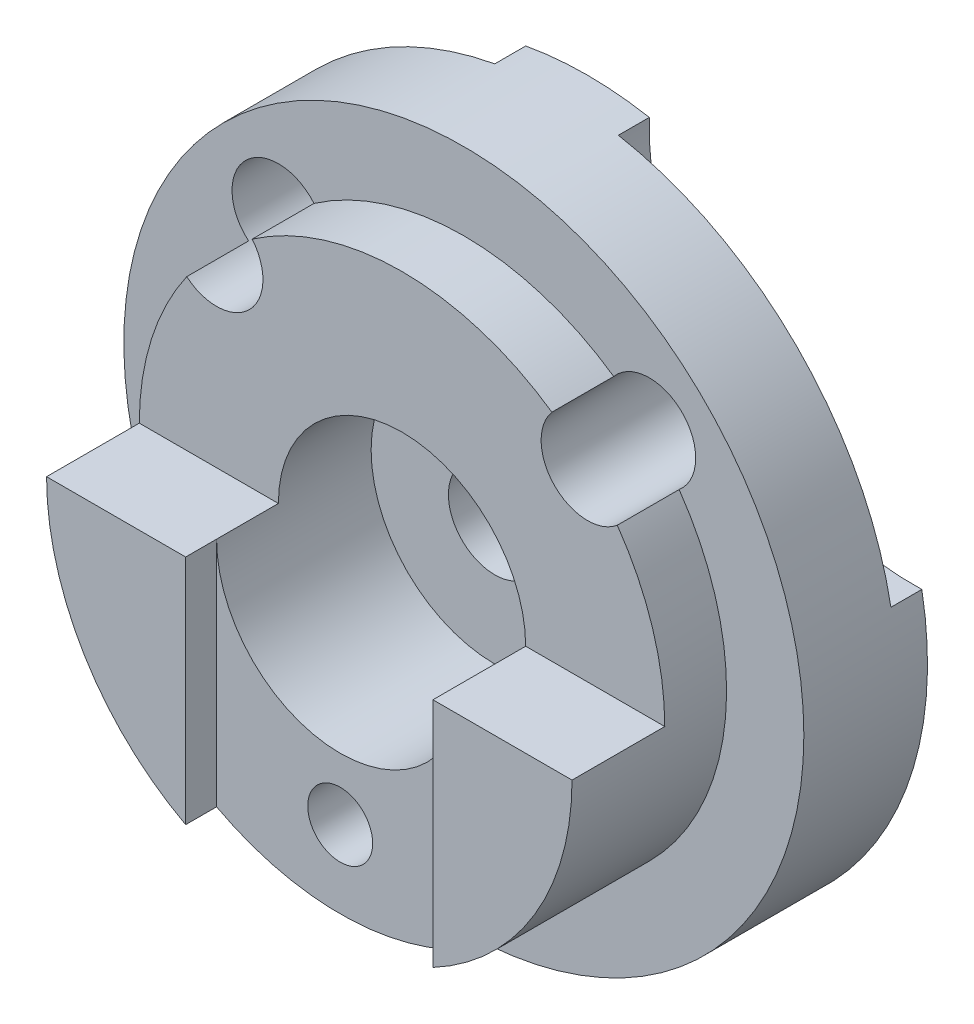
ISO-10303-21;
HEADER;
FILE_DESCRIPTION(('STEP AP214'),'2;1');
FILE_NAME('part.step','',(''),(''),'','','');
FILE_SCHEMA(('AUTOMOTIVE_DESIGN { 1 0 10303 214 1 1 1 1 }'));
ENDSEC;
DATA;
#1=APPLICATION_CONTEXT('core data for automotive mechanical design processes');
#2=APPLICATION_PROTOCOL_DEFINITION('international standard','automotive_design',2000,#1);
#3=PRODUCT_CONTEXT('',#1,'mechanical');
#4=PRODUCT('Part','Part','',(#3));
#5=PRODUCT_RELATED_PRODUCT_CATEGORY('part','',(#4));
#6=PRODUCT_DEFINITION_FORMATION('','',#4);
#7=PRODUCT_DEFINITION_CONTEXT('part definition',#1,'design');
#8=PRODUCT_DEFINITION('design','',#6,#7);
#9=PRODUCT_DEFINITION_SHAPE('','',#8);
#10=(LENGTH_UNIT() NAMED_UNIT(*) SI_UNIT(.MILLI.,.METRE.));
#11=(NAMED_UNIT(*) PLANE_ANGLE_UNIT() SI_UNIT($,.RADIAN.));
#12=(NAMED_UNIT(*) SI_UNIT($,.STERADIAN.) SOLID_ANGLE_UNIT());
#13=UNCERTAINTY_MEASURE_WITH_UNIT(LENGTH_MEASURE(1.E-05),#10,'distance_accuracy_value','');
#14=(GEOMETRIC_REPRESENTATION_CONTEXT(3) GLOBAL_UNCERTAINTY_ASSIGNED_CONTEXT((#13)) GLOBAL_UNIT_ASSIGNED_CONTEXT((#10,
#11,#12)) REPRESENTATION_CONTEXT('',''));
#15=CARTESIAN_POINT('',(0.,0.,0.));
#16=DIRECTION('',(0.,0.,1.));
#17=DIRECTION('',(1.,0.,0.));
#18=AXIS2_PLACEMENT_3D('',#15,#16,#17);
#19=CARTESIAN_POINT('',(0.,0.,15.));
#20=DIRECTION('',(0.,0.,-1.));
#21=DIRECTION('',(-1.,0.,0.));
#22=AXIS2_PLACEMENT_3D('',#19,#20,#21);
#23=CYLINDRICAL_SURFACE('',#22,55.);
#24=CARTESIAN_POINT('',(0.,0.,0.));
#25=DIRECTION('',(0.,0.,1.));
#26=DIRECTION('',(1.,0.,0.));
#27=AXIS2_PLACEMENT_3D('',#24,#25,#26);
#28=CIRCLE('',#27,55.);
#29=CARTESIAN_POINT('',(-54.0832691319598,10.,0.));
#30=VERTEX_POINT('',#29);
#31=CARTESIAN_POINT('',(54.0832691319598,10.,0.));
#32=VERTEX_POINT('',#31);
#33=EDGE_CURVE('E11',#30,#32,#28,.T.);
#34=ORIENTED_EDGE('',*,*,#33,.T.);
#35=DIRECTION('',(0.,0.,1.));
#36=VECTOR('',#35,1.);
#37=CARTESIAN_POINT('',(54.0832691319598,10.,0.));
#38=LINE('',#37,#36);
#39=CARTESIAN_POINT('',(54.0832691319598,10.,5.));
#40=VERTEX_POINT('',#39);
#41=EDGE_CURVE('E259',#32,#40,#38,.T.);
#42=ORIENTED_EDGE('',*,*,#41,.T.);
#43=CARTESIAN_POINT('',(0.,0.,5.));
#44=DIRECTION('',(0.,0.,-1.));
#45=DIRECTION('',(-1.,0.,0.));
#46=AXIS2_PLACEMENT_3D('',#43,#44,#45);
#47=CIRCLE('',#46,55.);
#48=CARTESIAN_POINT('',(10.,54.0832691319598,5.));
#49=VERTEX_POINT('',#48);
#50=EDGE_CURVE('E50',#49,#40,#47,.T.);
#51=ORIENTED_EDGE('',*,*,#50,.F.);
#52=DIRECTION('',(0.,0.,1.));
#53=VECTOR('',#52,1.);
#54=CARTESIAN_POINT('',(10.,54.0832691319598,0.));
#55=LINE('',#54,#53);
#56=CARTESIAN_POINT('',(10.,54.0832691319598,0.));
#57=VERTEX_POINT('',#56);
#58=EDGE_CURVE('E264',#57,#49,#55,.T.);
#59=ORIENTED_EDGE('',*,*,#58,.F.);
#60=CARTESIAN_POINT('',(0.,0.,0.));
#61=DIRECTION('',(0.,0.,-1.));
#62=DIRECTION('',(-1.,0.,0.));
#63=AXIS2_PLACEMENT_3D('',#60,#61,#62);
#64=CIRCLE('',#63,55.);
#65=CARTESIAN_POINT('',(-10.,54.0832691319598,0.));
#66=VERTEX_POINT('',#65);
#67=EDGE_CURVE('E252',#66,#57,#64,.T.);
#68=ORIENTED_EDGE('',*,*,#67,.F.);
#69=DIRECTION('',(0.,0.,1.));
#70=VECTOR('',#69,1.);
#71=CARTESIAN_POINT('',(-10.,54.0832691319598,0.));
#72=LINE('',#71,#70);
#73=CARTESIAN_POINT('',(-10.,54.0832691319598,5.));
#74=VERTEX_POINT('',#73);
#75=EDGE_CURVE('E267',#66,#74,#72,.T.);
#76=ORIENTED_EDGE('',*,*,#75,.T.);
#77=CARTESIAN_POINT('',(-54.0832691319598,10.,5.));
#78=VERTEX_POINT('',#77);
#79=EDGE_CURVE('E212',#78,#74,#47,.T.);
#80=ORIENTED_EDGE('',*,*,#79,.F.);
#81=DIRECTION('',(0.,0.,1.));
#82=VECTOR('',#81,1.);
#83=CARTESIAN_POINT('',(-54.0832691319598,10.,0.));
#84=LINE('',#83,#82);
#85=EDGE_CURVE('E270',#30,#78,#84,.T.);
#86=ORIENTED_EDGE('',*,*,#85,.F.);
#87=EDGE_LOOP('',(#34,#42,#51,#59,#68,#76,#80,#86));
#88=FACE_BOUND('',#87,.T.);
#89=CARTESIAN_POINT('',(0.,0.,20.));
#90=DIRECTION('',(0.,0.,1.));
#91=DIRECTION('',(1.,0.,0.));
#92=AXIS2_PLACEMENT_3D('',#89,#90,#91);
#93=CIRCLE('',#92,55.);
#94=CARTESIAN_POINT('',(55.,0.,20.));
#95=VERTEX_POINT('',#94);
#96=EDGE_CURVE('E276',#95,#95,#93,.T.);
#97=ORIENTED_EDGE('',*,*,#96,.F.);
#98=EDGE_LOOP('',(#97));
#99=FACE_BOUND('',#98,.T.);
#100=ADVANCED_FACE('F35',(#88,#99),#23,.T.);
#101=CARTESIAN_POINT('',(0.,0.,5.));
#102=DIRECTION('',(0.,0.,-1.));
#103=DIRECTION('',(-1.,0.,0.));
#104=AXIS2_PLACEMENT_3D('',#101,#102,#103);
#105=PLANE('',#104);
#106=CARTESIAN_POINT('',(30.,30.1039864469808,5.));
#107=DIRECTION('',(0.,0.,-1.));
#108=DIRECTION('',(-1.,0.,0.));
#109=AXIS2_PLACEMENT_3D('',#106,#107,#108);
#110=CIRCLE('',#109,7.5);
#111=CARTESIAN_POINT('',(22.5,30.1039864469808,5.));
#112=VERTEX_POINT('',#111);
#113=EDGE_CURVE('E189',#112,#112,#110,.T.);
#114=ORIENTED_EDGE('',*,*,#113,.F.);
#115=EDGE_LOOP('',(#114));
#116=FACE_BOUND('',#115,.T.);
#117=CARTESIAN_POINT('',(52.7294350376674,52.7294350376674,5.));
#118=DIRECTION('',(0.,0.,-1.));
#119=DIRECTION('',(-1.,0.,0.));
#120=AXIS2_PLACEMENT_3D('',#117,#118,#119);
#121=CIRCLE('',#120,42.7508770131457);
#122=EDGE_CURVE('E54',#40,#49,#121,.T.);
#123=ORIENTED_EDGE('',*,*,#122,.T.);
#124=ORIENTED_EDGE('',*,*,#50,.T.);
#125=EDGE_LOOP('',(#123,#124));
#126=FACE_BOUND('',#125,.T.);
#127=ADVANCED_FACE('F327',(#116,#126),#105,.T.);
#128=CARTESIAN_POINT('',(-70.,0.,30.));
#129=DIRECTION('',(0.,0.,-1.));
#130=DIRECTION('',(-1.,0.,0.));
#131=AXIS2_PLACEMENT_3D('',#128,#129,#130);
#132=PLANE('',#131);
#133=CARTESIAN_POINT('',(0.,0.,30.));
#134=DIRECTION('',(0.,0.,1.));
#135=DIRECTION('',(1.,0.,0.));
#136=AXIS2_PLACEMENT_3D('',#133,#134,#135);
#137=CIRCLE('',#136,42.5);
#138=CARTESIAN_POINT('',(42.5,0.,30.));
#139=VERTEX_POINT('',#138);
#140=CARTESIAN_POINT('',(34.824619737225,24.3617704643501,30.));
#141=VERTEX_POINT('',#140);
#142=EDGE_CURVE('E273',#139,#141,#137,.T.);
#143=ORIENTED_EDGE('',*,*,#142,.T.);
#144=CARTESIAN_POINT('',(30.,30.1039864469808,30.));
#145=DIRECTION('',(0.,0.,-1.));
#146=DIRECTION('',(-1.,0.,0.));
#147=AXIS2_PLACEMENT_3D('',#144,#145,#146);
#148=CIRCLE('',#147,7.5);
#149=CARTESIAN_POINT('',(24.2411242074117,34.9087080419892,30.));
#150=VERTEX_POINT('',#149);
#151=EDGE_CURVE('E155',#150,#141,#148,.F.);
#152=ORIENTED_EDGE('',*,*,#151,.F.);
#153=CARTESIAN_POINT('',(-24.2411242074117,34.9087080419892,30.));
#154=VERTEX_POINT('',#153);
#155=EDGE_CURVE('E277',#150,#154,#137,.T.);
#156=ORIENTED_EDGE('',*,*,#155,.T.);
#157=CARTESIAN_POINT('',(-30.,30.1039864469807,30.));
#158=DIRECTION('',(0.,0.,-1.));
#159=DIRECTION('',(-1.,0.,0.));
#160=AXIS2_PLACEMENT_3D('',#157,#158,#159);
#161=CIRCLE('',#160,7.5);
#162=CARTESIAN_POINT('',(-34.824619737225,24.3617704643501,30.));
#163=VERTEX_POINT('',#162);
#164=EDGE_CURVE('E207',#163,#154,#161,.F.);
#165=ORIENTED_EDGE('',*,*,#164,.F.);
#166=CARTESIAN_POINT('',(-42.5,0.,30.));
#167=VERTEX_POINT('',#166);
#168=EDGE_CURVE('E289',#163,#167,#137,.T.);
#169=ORIENTED_EDGE('',*,*,#168,.T.);
#170=DIRECTION('',(1.,0.,0.));
#171=VECTOR('',#170,1.);
#172=CARTESIAN_POINT('',(-70.,0.,30.));
#173=LINE('',#172,#171);
#174=CARTESIAN_POINT('',(-20.,0.,30.));
#175=VERTEX_POINT('',#174);
#176=EDGE_CURVE('E196',#167,#175,#173,.T.);
#177=ORIENTED_EDGE('',*,*,#176,.T.);
#178=CARTESIAN_POINT('',(0.,0.,30.));
#179=DIRECTION('',(0.,0.,-1.));
#180=DIRECTION('',(-1.,0.,0.));
#181=AXIS2_PLACEMENT_3D('',#178,#179,#180);
#182=CIRCLE('',#181,20.);
#183=CARTESIAN_POINT('',(20.,0.,30.));
#184=VERTEX_POINT('',#183);
#185=EDGE_CURVE('E151',#184,#175,#182,.F.);
#186=ORIENTED_EDGE('',*,*,#185,.F.);
#187=EDGE_CURVE('E192',#184,#139,#173,.T.);
#188=ORIENTED_EDGE('',*,*,#187,.T.);
#189=EDGE_LOOP('',(#143,#152,#156,#165,#169,#177,#186,#188));
#190=FACE_BOUND('',#189,.T.);
#191=ADVANCED_FACE('F332',(#190),#132,.F.);
#192=CARTESIAN_POINT('',(30.,30.1039864469808,15.));
#193=DIRECTION('',(0.,0.,1.));
#194=DIRECTION('',(1.,0.,0.));
#195=AXIS2_PLACEMENT_3D('',#192,#193,#194);
#196=CYLINDRICAL_SURFACE('',#195,7.5);
#197=ORIENTED_EDGE('',*,*,#113,.T.);
#198=EDGE_LOOP('',(#197));
#199=FACE_BOUND('',#198,.T.);
#200=DIRECTION('',(0.,0.,1.));
#201=VECTOR('',#200,1.);
#202=CARTESIAN_POINT('',(34.824619737225,24.3617704643501,20.));
#203=LINE('',#202,#201);
#204=CARTESIAN_POINT('',(34.824619737225,24.3617704643501,20.));
#205=VERTEX_POINT('',#204);
#206=EDGE_CURVE('E290',#205,#141,#203,.T.);
#207=ORIENTED_EDGE('',*,*,#206,.F.);
#208=CARTESIAN_POINT('',(30.,30.1039864469808,20.));
#209=DIRECTION('',(0.,0.,1.));
#210=DIRECTION('',(1.,0.,0.));
#211=AXIS2_PLACEMENT_3D('',#208,#209,#210);
#212=CIRCLE('',#211,7.5);
#213=CARTESIAN_POINT('',(24.2411242074117,34.9087080419892,20.));
#214=VERTEX_POINT('',#213);
#215=EDGE_CURVE('E284',#214,#205,#212,.F.);
#216=ORIENTED_EDGE('',*,*,#215,.F.);
#217=DIRECTION('',(0.,0.,1.));
#218=VECTOR('',#217,1.);
#219=CARTESIAN_POINT('',(24.2411242074117,34.9087080419892,20.));
#220=LINE('',#219,#218);
#221=EDGE_CURVE('E293',#214,#150,#220,.T.);
#222=ORIENTED_EDGE('',*,*,#221,.T.);
#223=ORIENTED_EDGE('',*,*,#151,.T.);
#224=EDGE_LOOP('',(#207,#216,#222,#223));
#225=FACE_BOUND('',#224,.T.);
#226=ADVANCED_FACE('F321',(#199,#225),#196,.F.);
#227=CARTESIAN_POINT('',(-30.,30.1039864469807,15.));
#228=DIRECTION('',(0.,0.,1.));
#229=DIRECTION('',(1.,0.,0.));
#230=AXIS2_PLACEMENT_3D('',#227,#228,#229);
#231=CYLINDRICAL_SURFACE('',#230,7.5);
#232=CARTESIAN_POINT('',(-30.,30.1039864469807,5.));
#233=DIRECTION('',(0.,0.,-1.));
#234=DIRECTION('',(-1.,0.,0.));
#235=AXIS2_PLACEMENT_3D('',#232,#233,#234);
#236=CIRCLE('',#235,7.5);
#237=CARTESIAN_POINT('',(-37.5,30.1039864469807,5.));
#238=VERTEX_POINT('',#237);
#239=EDGE_CURVE('E187',#238,#238,#236,.T.);
#240=ORIENTED_EDGE('',*,*,#239,.T.);
#241=EDGE_LOOP('',(#240));
#242=FACE_BOUND('',#241,.T.);
#243=DIRECTION('',(0.,0.,1.));
#244=VECTOR('',#243,1.);
#245=CARTESIAN_POINT('',(-24.2411242074117,34.9087080419892,20.));
#246=LINE('',#245,#244);
#247=CARTESIAN_POINT('',(-24.2411242074117,34.9087080419892,20.));
#248=VERTEX_POINT('',#247);
#249=EDGE_CURVE('E296',#248,#154,#246,.T.);
#250=ORIENTED_EDGE('',*,*,#249,.F.);
#251=CARTESIAN_POINT('',(-30.,30.1039864469807,20.));
#252=DIRECTION('',(0.,0.,1.));
#253=DIRECTION('',(1.,0.,0.));
#254=AXIS2_PLACEMENT_3D('',#251,#252,#253);
#255=CIRCLE('',#254,7.5);
#256=CARTESIAN_POINT('',(-34.824619737225,24.3617704643501,20.));
#257=VERTEX_POINT('',#256);
#258=EDGE_CURVE('E281',#257,#248,#255,.F.);
#259=ORIENTED_EDGE('',*,*,#258,.F.);
#260=DIRECTION('',(0.,0.,1.));
#261=VECTOR('',#260,1.);
#262=CARTESIAN_POINT('',(-34.824619737225,24.3617704643501,20.));
#263=LINE('',#262,#261);
#264=EDGE_CURVE('E287',#257,#163,#263,.T.);
#265=ORIENTED_EDGE('',*,*,#264,.T.);
#266=ORIENTED_EDGE('',*,*,#164,.T.);
#267=EDGE_LOOP('',(#250,#259,#265,#266));
#268=FACE_BOUND('',#267,.T.);
#269=ADVANCED_FACE('F314',(#242,#268),#231,.F.);
#270=CARTESIAN_POINT('',(0.,0.,-105.));
#271=DIRECTION('',(0.,0.,1.));
#272=DIRECTION('',(1.,0.,0.));
#273=AXIS2_PLACEMENT_3D('',#270,#271,#272);
#274=CYLINDRICAL_SURFACE('',#273,7.5);
#275=CARTESIAN_POINT('',(0.,0.,0.));
#276=DIRECTION('',(0.,0.,1.));
#277=DIRECTION('',(1.,0.,0.));
#278=AXIS2_PLACEMENT_3D('',#275,#276,#277);
#279=CIRCLE('',#278,7.5);
#280=CARTESIAN_POINT('',(7.5,0.,0.));
#281=VERTEX_POINT('',#280);
#282=EDGE_CURVE('E190',#281,#281,#279,.T.);
#283=ORIENTED_EDGE('',*,*,#282,.F.);
#284=EDGE_LOOP('',(#283));
#285=FACE_BOUND('',#284,.T.);
#286=CARTESIAN_POINT('',(0.,0.,15.));
#287=DIRECTION('',(0.,0.,1.));
#288=DIRECTION('',(1.,0.,0.));
#289=AXIS2_PLACEMENT_3D('',#286,#287,#288);
#290=CIRCLE('',#289,7.5);
#291=CARTESIAN_POINT('',(7.5,0.,15.));
#292=VERTEX_POINT('',#291);
#293=EDGE_CURVE('E38',#292,#292,#290,.F.);
#294=ORIENTED_EDGE('',*,*,#293,.F.);
#295=EDGE_LOOP('',(#294));
#296=FACE_BOUND('',#295,.T.);
#297=ADVANCED_FACE('F311',(#285,#296),#274,.F.);
#298=CARTESIAN_POINT('',(2.35922392732846E-13,1.52655665885959E-13,45.));
#299=DIRECTION('',(0.,0.,-1.));
#300=DIRECTION('',(-1.,0.,0.));
#301=AXIS2_PLACEMENT_3D('',#298,#299,#300);
#302=CYLINDRICAL_SURFACE('',#301,42.5000000000003);
#303=DIRECTION('',(0.,0.,-1.));
#304=VECTOR('',#303,1.);
#305=CARTESIAN_POINT('',(-42.5,0.,45.));
#306=LINE('',#305,#304);
#307=CARTESIAN_POINT('',(-42.5,0.,45.));
#308=VERTEX_POINT('',#307);
#309=EDGE_CURVE('E181',#308,#167,#306,.T.);
#310=ORIENTED_EDGE('',*,*,#309,.T.);
#311=ORIENTED_EDGE('',*,*,#168,.F.);
#312=ORIENTED_EDGE('',*,*,#264,.F.);
#313=CARTESIAN_POINT('',(0.,0.,20.));
#314=DIRECTION('',(0.,0.,1.));
#315=DIRECTION('',(1.,0.,0.));
#316=AXIS2_PLACEMENT_3D('',#313,#314,#315);
#317=CIRCLE('',#316,42.5);
#318=EDGE_CURVE('E274',#257,#205,#317,.T.);
#319=ORIENTED_EDGE('',*,*,#318,.T.);
#320=ORIENTED_EDGE('',*,*,#206,.T.);
#321=ORIENTED_EDGE('',*,*,#142,.F.);
#322=DIRECTION('',(0.,0.,-1.));
#323=VECTOR('',#322,1.);
#324=CARTESIAN_POINT('',(42.5,0.,45.));
#325=LINE('',#324,#323);
#326=CARTESIAN_POINT('',(42.5,0.,45.));
#327=VERTEX_POINT('',#326);
#328=EDGE_CURVE('E226',#327,#139,#325,.T.);
#329=ORIENTED_EDGE('',*,*,#328,.F.);
#330=CARTESIAN_POINT('',(1.45716771982052E-13,-1.00613961606655E-13,45.));
#331=DIRECTION('',(0.,0.,1.));
#332=DIRECTION('',(1.,0.,0.));
#333=AXIS2_PLACEMENT_3D('',#330,#331,#332);
#334=CIRCLE('',#333,42.4999999999999);
#335=CARTESIAN_POINT('',(20.,-37.5,45.));
#336=VERTEX_POINT('',#335);
#337=EDGE_CURVE('E213',#336,#327,#334,.T.);
#338=ORIENTED_EDGE('',*,*,#337,.F.);
#339=DIRECTION('',(0.,0.,-1.));
#340=VECTOR('',#339,1.);
#341=CARTESIAN_POINT('',(20.,-37.5,45.));
#342=LINE('',#341,#340);
#343=CARTESIAN_POINT('',(20.,-37.5,40.));
#344=VERTEX_POINT('',#343);
#345=EDGE_CURVE('E221',#336,#344,#342,.T.);
#346=ORIENTED_EDGE('',*,*,#345,.T.);
#347=CARTESIAN_POINT('',(0.,0.,40.));
#348=DIRECTION('',(0.,0.,1.));
#349=DIRECTION('',(1.,0.,0.));
#350=AXIS2_PLACEMENT_3D('',#347,#348,#349);
#351=CIRCLE('',#350,42.5);
#352=CARTESIAN_POINT('',(-20.,-37.5,40.));
#353=VERTEX_POINT('',#352);
#354=EDGE_CURVE('E176',#353,#344,#351,.T.);
#355=ORIENTED_EDGE('',*,*,#354,.F.);
#356=DIRECTION('',(0.,0.,-1.));
#357=VECTOR('',#356,1.);
#358=CARTESIAN_POINT('',(-20.,-37.5,45.));
#359=LINE('',#358,#357);
#360=CARTESIAN_POINT('',(-20.,-37.5,45.));
#361=VERTEX_POINT('',#360);
#362=EDGE_CURVE('E43',#361,#353,#359,.T.);
#363=ORIENTED_EDGE('',*,*,#362,.F.);
#364=CARTESIAN_POINT('',(2.35922392732846E-13,1.52655665885959E-13,45.));
#365=DIRECTION('',(0.,0.,1.));
#366=DIRECTION('',(1.,0.,0.));
#367=AXIS2_PLACEMENT_3D('',#364,#365,#366);
#368=CIRCLE('',#367,42.5000000000003);
#369=EDGE_CURVE('E228',#308,#361,#368,.T.);
#370=ORIENTED_EDGE('',*,*,#369,.F.);
#371=EDGE_LOOP('',(#310,#311,#312,#319,#320,#321,#329,#338,#346,#355,#363,#370));
#372=FACE_BOUND('',#371,.T.);
#373=ADVANCED_FACE('F237',(#372),#302,.T.);
#374=CARTESIAN_POINT('',(-20.,-37.5,45.));
#375=DIRECTION('',(-1.,0.,0.));
#376=DIRECTION('',(0.,0.,1.));
#377=AXIS2_PLACEMENT_3D('',#374,#375,#376);
#378=PLANE('',#377);
#379=ORIENTED_EDGE('',*,*,#362,.T.);
#380=DIRECTION('',(0.,-1.,0.));
#381=VECTOR('',#380,1.);
#382=CARTESIAN_POINT('',(-20.,0.,40.));
#383=LINE('',#382,#381);
#384=CARTESIAN_POINT('',(-20.,0.,40.));
#385=VERTEX_POINT('',#384);
#386=EDGE_CURVE('E163',#385,#353,#383,.T.);
#387=ORIENTED_EDGE('',*,*,#386,.F.);
#388=DIRECTION('',(0.,0.,-1.));
#389=VECTOR('',#388,1.);
#390=CARTESIAN_POINT('',(-20.,0.,45.));
#391=LINE('',#390,#389);
#392=CARTESIAN_POINT('',(-20.,0.,45.));
#393=VERTEX_POINT('',#392);
#394=EDGE_CURVE('E173',#393,#385,#391,.T.);
#395=ORIENTED_EDGE('',*,*,#394,.F.);
#396=DIRECTION('',(0.,1.,0.));
#397=VECTOR('',#396,1.);
#398=CARTESIAN_POINT('',(-20.,-37.5,45.));
#399=LINE('',#398,#397);
#400=EDGE_CURVE('E231',#361,#393,#399,.T.);
#401=ORIENTED_EDGE('',*,*,#400,.F.);
#402=EDGE_LOOP('',(#379,#387,#395,#401));
#403=FACE_BOUND('',#402,.T.);
#404=ADVANCED_FACE('F172',(#403),#378,.F.);
#405=CARTESIAN_POINT('',(-20.,0.,45.));
#406=DIRECTION('',(0.,-1.,0.));
#407=DIRECTION('',(1.,0.,0.));
#408=AXIS2_PLACEMENT_3D('',#405,#406,#407);
#409=PLANE('',#408);
#410=ORIENTED_EDGE('',*,*,#176,.F.);
#411=ORIENTED_EDGE('',*,*,#309,.F.);
#412=DIRECTION('',(-1.,0.,0.));
#413=VECTOR('',#412,1.);
#414=CARTESIAN_POINT('',(-20.,0.,45.));
#415=LINE('',#414,#413);
#416=EDGE_CURVE('E180',#393,#308,#415,.T.);
#417=ORIENTED_EDGE('',*,*,#416,.F.);
#418=ORIENTED_EDGE('',*,*,#394,.T.);
#419=DIRECTION('',(0.,0.,1.));
#420=VECTOR('',#419,1.);
#421=CARTESIAN_POINT('',(-20.,0.,15.));
#422=LINE('',#421,#420);
#423=EDGE_CURVE('E144',#175,#385,#422,.T.);
#424=ORIENTED_EDGE('',*,*,#423,.F.);
#425=EDGE_LOOP('',(#410,#411,#417,#418,#424));
#426=FACE_BOUND('',#425,.T.);
#427=ADVANCED_FACE('F178',(#426),#409,.F.);
#428=CARTESIAN_POINT('',(2.35922392732846E-13,1.52655665885959E-13,45.));
#429=DIRECTION('',(0.,0.,1.));
#430=DIRECTION('',(1.,0.,0.));
#431=AXIS2_PLACEMENT_3D('',#428,#429,#430);
#432=PLANE('',#431);
#433=ORIENTED_EDGE('',*,*,#369,.T.);
#434=ORIENTED_EDGE('',*,*,#400,.T.);
#435=ORIENTED_EDGE('',*,*,#416,.T.);
#436=EDGE_LOOP('',(#433,#434,#435));
#437=FACE_BOUND('',#436,.T.);
#438=ADVANCED_FACE('F233',(#437),#432,.T.);
#439=CARTESIAN_POINT('',(42.5,0.,45.));
#440=DIRECTION('',(0.,-1.,0.));
#441=DIRECTION('',(1.,0.,0.));
#442=AXIS2_PLACEMENT_3D('',#439,#440,#441);
#443=PLANE('',#442);
#444=ORIENTED_EDGE('',*,*,#328,.T.);
#445=ORIENTED_EDGE('',*,*,#187,.F.);
#446=DIRECTION('',(0.,0.,1.));
#447=VECTOR('',#446,1.);
#448=CARTESIAN_POINT('',(20.,0.,15.));
#449=LINE('',#448,#447);
#450=CARTESIAN_POINT('',(20.,0.,40.));
#451=VERTEX_POINT('',#450);
#452=EDGE_CURVE('E156',#451,#184,#449,.F.);
#453=ORIENTED_EDGE('',*,*,#452,.F.);
#454=DIRECTION('',(0.,0.,-1.));
#455=VECTOR('',#454,1.);
#456=CARTESIAN_POINT('',(20.,0.,45.));
#457=LINE('',#456,#455);
#458=CARTESIAN_POINT('',(20.,0.,45.));
#459=VERTEX_POINT('',#458);
#460=EDGE_CURVE('E224',#459,#451,#457,.T.);
#461=ORIENTED_EDGE('',*,*,#460,.F.);
#462=DIRECTION('',(-1.,0.,0.));
#463=VECTOR('',#462,1.);
#464=CARTESIAN_POINT('',(42.5,0.,45.));
#465=LINE('',#464,#463);
#466=EDGE_CURVE('E216',#327,#459,#465,.T.);
#467=ORIENTED_EDGE('',*,*,#466,.F.);
#468=EDGE_LOOP('',(#444,#445,#453,#461,#467));
#469=FACE_BOUND('',#468,.T.);
#470=ADVANCED_FACE('F383',(#469),#443,.F.);
#471=CARTESIAN_POINT('',(20.,0.,45.));
#472=DIRECTION('',(1.,0.,0.));
#473=DIRECTION('',(0.,0.,-1.));
#474=AXIS2_PLACEMENT_3D('',#471,#472,#473);
#475=PLANE('',#474);
#476=ORIENTED_EDGE('',*,*,#460,.T.);
#477=DIRECTION('',(0.,1.,0.));
#478=VECTOR('',#477,1.);
#479=CARTESIAN_POINT('',(20.,-37.5,40.));
#480=LINE('',#479,#478);
#481=EDGE_CURVE('E166',#344,#451,#480,.T.);
#482=ORIENTED_EDGE('',*,*,#481,.F.);
#483=ORIENTED_EDGE('',*,*,#345,.F.);
#484=DIRECTION('',(0.,-1.,0.));
#485=VECTOR('',#484,1.);
#486=CARTESIAN_POINT('',(20.,0.,45.));
#487=LINE('',#486,#485);
#488=EDGE_CURVE('E218',#459,#336,#487,.T.);
#489=ORIENTED_EDGE('',*,*,#488,.F.);
#490=EDGE_LOOP('',(#476,#482,#483,#489));
#491=FACE_BOUND('',#490,.T.);
#492=ADVANCED_FACE('F379',(#491),#475,.F.);
#493=CARTESIAN_POINT('',(1.45716771982052E-13,-1.00613961606655E-13,45.));
#494=DIRECTION('',(0.,0.,1.));
#495=DIRECTION('',(1.,0.,0.));
#496=AXIS2_PLACEMENT_3D('',#493,#494,#495);
#497=PLANE('',#496);
#498=ORIENTED_EDGE('',*,*,#337,.T.);
#499=ORIENTED_EDGE('',*,*,#466,.T.);
#500=ORIENTED_EDGE('',*,*,#488,.T.);
#501=EDGE_LOOP('',(#498,#499,#500));
#502=FACE_BOUND('',#501,.T.);
#503=ADVANCED_FACE('F376',(#502),#497,.T.);
#504=CARTESIAN_POINT('',(0.,0.,15.));
#505=DIRECTION('',(0.,0.,1.));
#506=DIRECTION('',(1.,0.,0.));
#507=AXIS2_PLACEMENT_3D('',#504,#505,#506);
#508=CYLINDRICAL_SURFACE('',#507,20.);
#509=ORIENTED_EDGE('',*,*,#423,.T.);
#510=CARTESIAN_POINT('',(0.,0.,40.));
#511=DIRECTION('',(0.,0.,-1.));
#512=DIRECTION('',(1.,0.,0.));
#513=AXIS2_PLACEMENT_3D('',#510,#511,#512);
#514=CIRCLE('',#513,20.);
#515=EDGE_CURVE('E149',#451,#385,#514,.T.);
#516=ORIENTED_EDGE('',*,*,#515,.F.);
#517=ORIENTED_EDGE('',*,*,#452,.T.);
#518=ORIENTED_EDGE('',*,*,#185,.T.);
#519=EDGE_LOOP('',(#509,#516,#517,#518));
#520=FACE_BOUND('',#519,.T.);
#521=CARTESIAN_POINT('',(0.,0.,15.));
#522=DIRECTION('',(0.,0.,1.));
#523=DIRECTION('',(1.,0.,0.));
#524=AXIS2_PLACEMENT_3D('',#521,#522,#523);
#525=CIRCLE('',#524,20.);
#526=CARTESIAN_POINT('',(20.,0.,15.));
#527=VERTEX_POINT('',#526);
#528=EDGE_CURVE('E292',#527,#527,#525,.T.);
#529=ORIENTED_EDGE('',*,*,#528,.F.);
#530=EDGE_LOOP('',(#529));
#531=FACE_BOUND('',#530,.T.);
#532=ADVANCED_FACE('F146',(#520,#531),#508,.F.);
#533=CARTESIAN_POINT('',(-27.5,17.95836543402,0.));
#534=DIRECTION('',(0.,0.,1.));
#535=DIRECTION('',(1.,0.,0.));
#536=AXIS2_PLACEMENT_3D('',#533,#534,#535);
#537=PLANE('',#536);
#538=CARTESIAN_POINT('',(0.,-50.,0.));
#539=DIRECTION('',(0.,0.,1.));
#540=DIRECTION('',(1.,0.,0.));
#541=AXIS2_PLACEMENT_3D('',#538,#539,#540);
#542=CIRCLE('',#541,2.5);
#543=CARTESIAN_POINT('',(2.5,-50.,0.));
#544=VERTEX_POINT('',#543);
#545=EDGE_CURVE('E243',#544,#544,#542,.T.);
#546=ORIENTED_EDGE('',*,*,#545,.T.);
#547=EDGE_LOOP('',(#546));
#548=FACE_BOUND('',#547,.T.);
#549=ORIENTED_EDGE('',*,*,#282,.T.);
#550=EDGE_LOOP('',(#549));
#551=FACE_BOUND('',#550,.T.);
#552=ORIENTED_EDGE('',*,*,#33,.F.);
#553=CARTESIAN_POINT('',(-52.7294350376674,52.7294350376674,0.));
#554=DIRECTION('',(0.,0.,-1.));
#555=DIRECTION('',(-1.,0.,0.));
#556=AXIS2_PLACEMENT_3D('',#553,#554,#555);
#557=CIRCLE('',#556,42.7508770131457);
#558=EDGE_CURVE('E255',#30,#66,#557,.F.);
#559=ORIENTED_EDGE('',*,*,#558,.T.);
#560=ORIENTED_EDGE('',*,*,#67,.T.);
#561=CARTESIAN_POINT('',(52.7294350376674,52.7294350376674,0.));
#562=DIRECTION('',(0.,0.,-1.));
#563=DIRECTION('',(-1.,0.,0.));
#564=AXIS2_PLACEMENT_3D('',#561,#562,#563);
#565=CIRCLE('',#564,42.7508770131457);
#566=EDGE_CURVE('E254',#32,#57,#565,.T.);
#567=ORIENTED_EDGE('',*,*,#566,.F.);
#568=EDGE_LOOP('',(#552,#559,#560,#567));
#569=FACE_BOUND('',#568,.T.);
#570=ADVANCED_FACE('F308',(#548,#551,#569),#537,.F.);
#571=ORIENTED_EDGE('',*,*,#239,.F.);
#572=EDGE_LOOP('',(#571));
#573=FACE_BOUND('',#572,.T.);
#574=ORIENTED_EDGE('',*,*,#79,.T.);
#575=CARTESIAN_POINT('',(-52.7294350376674,52.7294350376674,5.));
#576=DIRECTION('',(0.,0.,-1.));
#577=DIRECTION('',(-1.,0.,0.));
#578=AXIS2_PLACEMENT_3D('',#575,#576,#577);
#579=CIRCLE('',#578,42.7508770131457);
#580=EDGE_CURVE('E251',#78,#74,#579,.F.);
#581=ORIENTED_EDGE('',*,*,#580,.F.);
#582=EDGE_LOOP('',(#574,#581));
#583=FACE_BOUND('',#582,.T.);
#584=ADVANCED_FACE('F335',(#573,#583),#105,.T.);
#585=CARTESIAN_POINT('',(0.,0.,15.));
#586=DIRECTION('',(0.,0.,1.));
#587=DIRECTION('',(1.,0.,0.));
#588=AXIS2_PLACEMENT_3D('',#585,#586,#587);
#589=PLANE('',#588);
#590=ORIENTED_EDGE('',*,*,#528,.T.);
#591=EDGE_LOOP('',(#590));
#592=FACE_BOUND('',#591,.T.);
#593=ORIENTED_EDGE('',*,*,#293,.T.);
#594=EDGE_LOOP('',(#593));
#595=FACE_BOUND('',#594,.T.);
#596=ADVANCED_FACE('F354',(#592,#595),#589,.T.);
#597=CARTESIAN_POINT('',(0.,0.,20.));
#598=DIRECTION('',(0.,0.,1.));
#599=DIRECTION('',(1.,0.,0.));
#600=AXIS2_PLACEMENT_3D('',#597,#598,#599);
#601=CYLINDRICAL_SURFACE('',#600,42.5);
#602=ORIENTED_EDGE('',*,*,#155,.F.);
#603=ORIENTED_EDGE('',*,*,#221,.F.);
#604=EDGE_CURVE('E278',#214,#248,#317,.T.);
#605=ORIENTED_EDGE('',*,*,#604,.T.);
#606=ORIENTED_EDGE('',*,*,#249,.T.);
#607=EDGE_LOOP('',(#602,#603,#605,#606));
#608=FACE_BOUND('',#607,.T.);
#609=ADVANCED_FACE('F344',(#608),#601,.T.);
#610=CARTESIAN_POINT('',(0.,0.,20.));
#611=DIRECTION('',(0.,0.,1.));
#612=DIRECTION('',(1.,0.,0.));
#613=AXIS2_PLACEMENT_3D('',#610,#611,#612);
#614=PLANE('',#613);
#615=CARTESIAN_POINT('',(0.,-50.,20.));
#616=DIRECTION('',(0.,0.,1.));
#617=DIRECTION('',(1.,0.,0.));
#618=AXIS2_PLACEMENT_3D('',#615,#616,#617);
#619=CIRCLE('',#618,2.5);
#620=CARTESIAN_POINT('',(2.5,-50.,20.));
#621=VERTEX_POINT('',#620);
#622=EDGE_CURVE('E240',#621,#621,#619,.T.);
#623=ORIENTED_EDGE('',*,*,#622,.F.);
#624=EDGE_LOOP('',(#623));
#625=FACE_BOUND('',#624,.T.);
#626=ORIENTED_EDGE('',*,*,#318,.F.);
#627=ORIENTED_EDGE('',*,*,#258,.T.);
#628=ORIENTED_EDGE('',*,*,#604,.F.);
#629=ORIENTED_EDGE('',*,*,#215,.T.);
#630=EDGE_LOOP('',(#626,#627,#628,#629));
#631=FACE_BOUND('',#630,.T.);
#632=ORIENTED_EDGE('',*,*,#96,.T.);
#633=EDGE_LOOP('',(#632));
#634=FACE_BOUND('',#633,.T.);
#635=ADVANCED_FACE('F341',(#625,#631,#634),#614,.T.);
#636=CARTESIAN_POINT('',(-52.7294350376674,52.7294350376674,0.));
#637=DIRECTION('',(0.,0.,1.));
#638=DIRECTION('',(1.,0.,0.));
#639=AXIS2_PLACEMENT_3D('',#636,#637,#638);
#640=CYLINDRICAL_SURFACE('',#639,42.7508770131457);
#641=ORIENTED_EDGE('',*,*,#580,.T.);
#642=ORIENTED_EDGE('',*,*,#75,.F.);
#643=ORIENTED_EDGE('',*,*,#558,.F.);
#644=ORIENTED_EDGE('',*,*,#85,.T.);
#645=EDGE_LOOP('',(#641,#642,#643,#644));
#646=FACE_BOUND('',#645,.T.);
#647=ADVANCED_FACE('F343',(#646),#640,.F.);
#648=CARTESIAN_POINT('',(52.7294350376674,52.7294350376674,0.));
#649=DIRECTION('',(0.,0.,1.));
#650=DIRECTION('',(1.,0.,0.));
#651=AXIS2_PLACEMENT_3D('',#648,#649,#650);
#652=CYLINDRICAL_SURFACE('',#651,42.7508770131457);
#653=ORIENTED_EDGE('',*,*,#122,.F.);
#654=ORIENTED_EDGE('',*,*,#41,.F.);
#655=ORIENTED_EDGE('',*,*,#566,.T.);
#656=ORIENTED_EDGE('',*,*,#58,.T.);
#657=EDGE_LOOP('',(#653,#654,#655,#656));
#658=FACE_BOUND('',#657,.T.);
#659=ADVANCED_FACE('F351',(#658),#652,.F.);
#660=CARTESIAN_POINT('',(0.,-50.,0.));
#661=DIRECTION('',(0.,0.,1.));
#662=DIRECTION('',(1.,0.,0.));
#663=AXIS2_PLACEMENT_3D('',#660,#661,#662);
#664=CYLINDRICAL_SURFACE('',#663,2.5);
#665=ORIENTED_EDGE('',*,*,#545,.F.);
#666=EDGE_LOOP('',(#665));
#667=FACE_BOUND('',#666,.T.);
#668=ORIENTED_EDGE('',*,*,#622,.T.);
#669=EDGE_LOOP('',(#668));
#670=FACE_BOUND('',#669,.T.);
#671=ADVANCED_FACE('F445',(#667,#670),#664,.F.);
#672=CARTESIAN_POINT('',(0.,0.,40.));
#673=DIRECTION('',(0.,0.,1.));
#674=DIRECTION('',(1.,0.,0.));
#675=AXIS2_PLACEMENT_3D('',#672,#673,#674);
#676=PLANE('',#675);
#677=ORIENTED_EDGE('',*,*,#515,.T.);
#678=ORIENTED_EDGE('',*,*,#386,.T.);
#679=ORIENTED_EDGE('',*,*,#354,.T.);
#680=ORIENTED_EDGE('',*,*,#481,.T.);
#681=EDGE_LOOP('',(#677,#678,#679,#680));
#682=FACE_BOUND('',#681,.T.);
#683=CARTESIAN_POINT('',(0.,-30.,40.));
#684=DIRECTION('',(0.,0.,1.));
#685=DIRECTION('',(1.,0.,0.));
#686=AXIS2_PLACEMENT_3D('',#683,#684,#685);
#687=CIRCLE('',#686,5.25);
#688=CARTESIAN_POINT('',(5.25,-30.,40.));
#689=VERTEX_POINT('',#688);
#690=EDGE_CURVE('E167',#689,#689,#687,.T.);
#691=ORIENTED_EDGE('',*,*,#690,.F.);
#692=EDGE_LOOP('',(#691));
#693=FACE_BOUND('',#692,.T.);
#694=ADVANCED_FACE('F161',(#682,#693),#676,.T.);
#695=CARTESIAN_POINT('',(0.,-30.,25.));
#696=DIRECTION('',(0.,0.,1.));
#697=DIRECTION('',(1.,0.,0.));
#698=AXIS2_PLACEMENT_3D('',#695,#696,#697);
#699=CONICAL_SURFACE('',#698,5.25,1.02974425867665);
#700=CARTESIAN_POINT('',(0.,-30.,21.8454817501053));
#701=VERTEX_POINT('',#700);
#702=VERTEX_LOOP('',#701);
#703=FACE_BOUND('',#702,.T.);
#704=CARTESIAN_POINT('',(0.,-30.,25.));
#705=DIRECTION('',(0.,0.,1.));
#706=DIRECTION('',(1.,0.,0.));
#707=AXIS2_PLACEMENT_3D('',#704,#705,#706);
#708=CIRCLE('',#707,5.25);
#709=CARTESIAN_POINT('',(5.25,-30.,25.));
#710=VERTEX_POINT('',#709);
#711=EDGE_CURVE('E246',#710,#710,#708,.T.);
#712=ORIENTED_EDGE('',*,*,#711,.T.);
#713=EDGE_LOOP('',(#712));
#714=FACE_BOUND('',#713,.T.);
#715=ADVANCED_FACE('F474',(#703,#714),#699,.F.);
#716=CARTESIAN_POINT('',(0.,-30.,35.));
#717=DIRECTION('',(0.,0.,1.));
#718=DIRECTION('',(1.,0.,0.));
#719=AXIS2_PLACEMENT_3D('',#716,#717,#718);
#720=CYLINDRICAL_SURFACE('',#719,5.25);
#721=ORIENTED_EDGE('',*,*,#711,.F.);
#722=EDGE_LOOP('',(#721));
#723=FACE_BOUND('',#722,.T.);
#724=ORIENTED_EDGE('',*,*,#690,.T.);
#725=EDGE_LOOP('',(#724));
#726=FACE_BOUND('',#725,.T.);
#727=ADVANCED_FACE('F478',(#723,#726),#720,.F.);
#728=CLOSED_SHELL('',(#100,#127,#191,#226,#269,#297,#373,#404,#427,#438,#470,#492,#503,#532,
#570,#584,#596,#609,#635,#647,#659,#671,#694,#715,#727));
#729=MANIFOLD_SOLID_BREP('B2',#728);
#730=ADVANCED_BREP_SHAPE_REPRESENTATION('',(#18,#729),#14);
#731=SHAPE_DEFINITION_REPRESENTATION(#9,#730);
ENDSEC;
END-ISO-10303-21;
